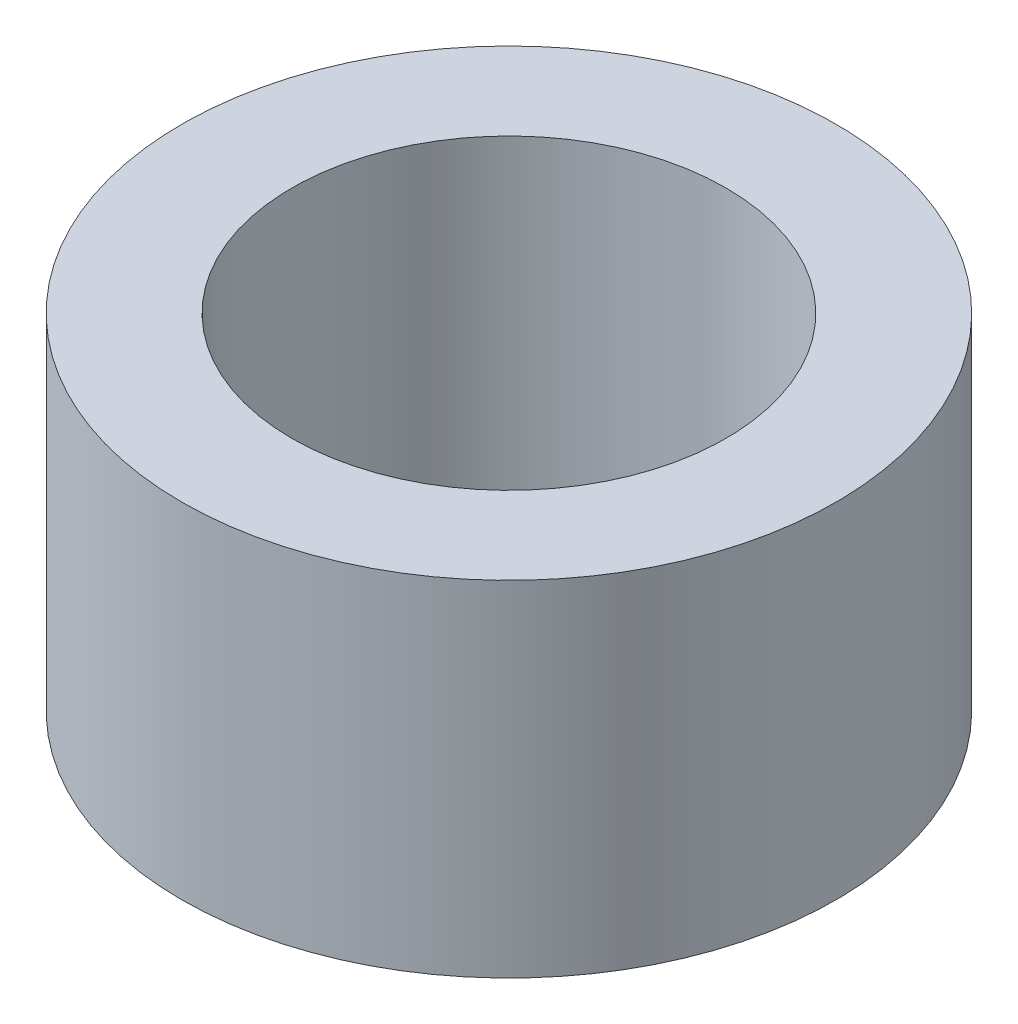
ISO-10303-21;
HEADER;
FILE_DESCRIPTION(('STEP AP214'),'2;1');
FILE_NAME('part.step','',(''),(''),'','','');
FILE_SCHEMA(('AUTOMOTIVE_DESIGN { 1 0 10303 214 1 1 1 1 }'));
ENDSEC;
DATA;
#1=APPLICATION_CONTEXT('core data for automotive mechanical design processes');
#2=APPLICATION_PROTOCOL_DEFINITION('international standard','automotive_design',2000,#1);
#3=PRODUCT_CONTEXT('',#1,'mechanical');
#4=PRODUCT('Part','Part','',(#3));
#5=PRODUCT_RELATED_PRODUCT_CATEGORY('part','',(#4));
#6=PRODUCT_DEFINITION_FORMATION('','',#4);
#7=PRODUCT_DEFINITION_CONTEXT('part definition',#1,'design');
#8=PRODUCT_DEFINITION('design','',#6,#7);
#9=PRODUCT_DEFINITION_SHAPE('','',#8);
#10=(LENGTH_UNIT() NAMED_UNIT(*) SI_UNIT(.MILLI.,.METRE.));
#11=(NAMED_UNIT(*) PLANE_ANGLE_UNIT() SI_UNIT($,.RADIAN.));
#12=(NAMED_UNIT(*) SI_UNIT($,.STERADIAN.) SOLID_ANGLE_UNIT());
#13=UNCERTAINTY_MEASURE_WITH_UNIT(LENGTH_MEASURE(1.E-05),#10,'distance_accuracy_value','');
#14=(GEOMETRIC_REPRESENTATION_CONTEXT(3) GLOBAL_UNCERTAINTY_ASSIGNED_CONTEXT((#13)) GLOBAL_UNIT_ASSIGNED_CONTEXT((#10,
#11,#12)) REPRESENTATION_CONTEXT('',''));
#15=CARTESIAN_POINT('',(0.,0.,0.));
#16=DIRECTION('',(0.,0.,1.));
#17=DIRECTION('',(1.,0.,0.));
#18=AXIS2_PLACEMENT_3D('',#15,#16,#17);
#19=CARTESIAN_POINT('',(0.,10.,0.));
#20=DIRECTION('',(0.,1.,0.));
#21=DIRECTION('',(0.,0.,1.));
#22=AXIS2_PLACEMENT_3D('',#19,#20,#21);
#23=PLANE('',#22);
#24=CARTESIAN_POINT('',(0.,10.,0.));
#25=DIRECTION('',(0.,1.,0.));
#26=DIRECTION('',(0.,0.,1.));
#27=AXIS2_PLACEMENT_3D('',#24,#25,#26);
#28=CIRCLE('',#27,9.5);
#29=CARTESIAN_POINT('',(0.,10.,9.5));
#30=VERTEX_POINT('',#29);
#31=EDGE_CURVE('E10',#30,#30,#28,.T.);
#32=ORIENTED_EDGE('',*,*,#31,.T.);
#33=EDGE_LOOP('',(#32));
#34=FACE_BOUND('',#33,.T.);
#35=CARTESIAN_POINT('',(0.,10.,0.));
#36=DIRECTION('',(0.,1.,0.));
#37=DIRECTION('',(0.,0.,1.));
#38=AXIS2_PLACEMENT_3D('',#35,#36,#37);
#39=CIRCLE('',#38,6.3);
#40=CARTESIAN_POINT('',(0.,10.,6.3));
#41=VERTEX_POINT('',#40);
#42=EDGE_CURVE('E43',#41,#41,#39,.T.);
#43=ORIENTED_EDGE('',*,*,#42,.F.);
#44=EDGE_LOOP('',(#43));
#45=FACE_BOUND('',#44,.T.);
#46=ADVANCED_FACE('F32',(#34,#45),#23,.T.);
#47=CARTESIAN_POINT('',(0.,0.,0.));
#48=DIRECTION('',(0.,1.,0.));
#49=DIRECTION('',(0.,0.,1.));
#50=AXIS2_PLACEMENT_3D('',#47,#48,#49);
#51=PLANE('',#50);
#52=CARTESIAN_POINT('',(0.,0.,0.));
#53=DIRECTION('',(0.,1.,0.));
#54=DIRECTION('',(0.,0.,1.));
#55=AXIS2_PLACEMENT_3D('',#52,#53,#54);
#56=CIRCLE('',#55,9.5);
#57=CARTESIAN_POINT('',(0.,0.,9.5));
#58=VERTEX_POINT('',#57);
#59=EDGE_CURVE('E36',#58,#58,#56,.T.);
#60=ORIENTED_EDGE('',*,*,#59,.F.);
#61=EDGE_LOOP('',(#60));
#62=FACE_BOUND('',#61,.T.);
#63=CARTESIAN_POINT('',(0.,0.,0.));
#64=DIRECTION('',(0.,1.,0.));
#65=DIRECTION('',(0.,0.,1.));
#66=AXIS2_PLACEMENT_3D('',#63,#64,#65);
#67=CIRCLE('',#66,6.3);
#68=CARTESIAN_POINT('',(0.,0.,6.3));
#69=VERTEX_POINT('',#68);
#70=EDGE_CURVE('E45',#69,#69,#67,.T.);
#71=ORIENTED_EDGE('',*,*,#70,.T.);
#72=EDGE_LOOP('',(#71));
#73=FACE_BOUND('',#72,.T.);
#74=ADVANCED_FACE('F55',(#62,#73),#51,.F.);
#75=CARTESIAN_POINT('',(0.,10.,0.));
#76=DIRECTION('',(0.,-1.,0.));
#77=DIRECTION('',(0.,0.,-1.));
#78=AXIS2_PLACEMENT_3D('',#75,#76,#77);
#79=CYLINDRICAL_SURFACE('',#78,9.5);
#80=ORIENTED_EDGE('',*,*,#31,.F.);
#81=EDGE_LOOP('',(#80));
#82=FACE_BOUND('',#81,.T.);
#83=ORIENTED_EDGE('',*,*,#59,.T.);
#84=EDGE_LOOP('',(#83));
#85=FACE_BOUND('',#84,.T.);
#86=ADVANCED_FACE('F34',(#82,#85),#79,.T.);
#87=CARTESIAN_POINT('',(0.,10.,0.));
#88=DIRECTION('',(0.,-1.,0.));
#89=DIRECTION('',(0.,0.,-1.));
#90=AXIS2_PLACEMENT_3D('',#87,#88,#89);
#91=CYLINDRICAL_SURFACE('',#90,6.3);
#92=ORIENTED_EDGE('',*,*,#42,.T.);
#93=EDGE_LOOP('',(#92));
#94=FACE_BOUND('',#93,.T.);
#95=ORIENTED_EDGE('',*,*,#70,.F.);
#96=EDGE_LOOP('',(#95));
#97=FACE_BOUND('',#96,.T.);
#98=ADVANCED_FACE('F51',(#94,#97),#91,.F.);
#99=CLOSED_SHELL('',(#46,#74,#86,#98));
#100=MANIFOLD_SOLID_BREP('B2',#99);
#101=ADVANCED_BREP_SHAPE_REPRESENTATION('',(#18,#100),#14);
#102=SHAPE_DEFINITION_REPRESENTATION(#9,#101);
ENDSEC;
END-ISO-10303-21;
